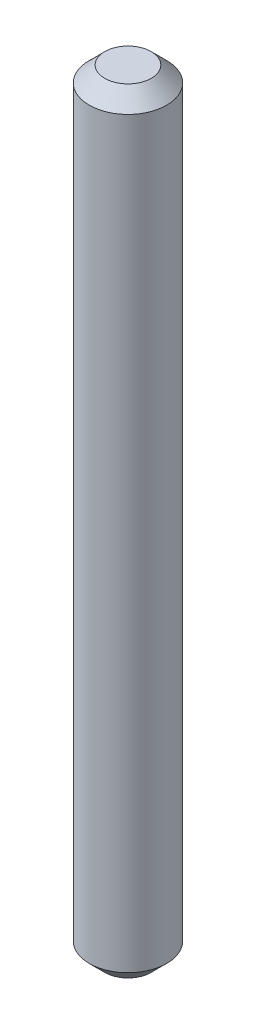
ISO-10303-21;
HEADER;
FILE_DESCRIPTION(('STEP AP214'),'2;1');
FILE_NAME('part.step','',(''),(''),'','','');
FILE_SCHEMA(('AUTOMOTIVE_DESIGN { 1 0 10303 214 1 1 1 1 }'));
ENDSEC;
DATA;
#1=APPLICATION_CONTEXT('core data for automotive mechanical design processes');
#2=APPLICATION_PROTOCOL_DEFINITION('international standard','automotive_design',2000,#1);
#3=PRODUCT_CONTEXT('',#1,'mechanical');
#4=PRODUCT('Part','Part','',(#3));
#5=PRODUCT_RELATED_PRODUCT_CATEGORY('part','',(#4));
#6=PRODUCT_DEFINITION_FORMATION('','',#4);
#7=PRODUCT_DEFINITION_CONTEXT('part definition',#1,'design');
#8=PRODUCT_DEFINITION('design','',#6,#7);
#9=PRODUCT_DEFINITION_SHAPE('','',#8);
#10=(LENGTH_UNIT() NAMED_UNIT(*) SI_UNIT(.MILLI.,.METRE.));
#11=(NAMED_UNIT(*) PLANE_ANGLE_UNIT() SI_UNIT($,.RADIAN.));
#12=(NAMED_UNIT(*) SI_UNIT($,.STERADIAN.) SOLID_ANGLE_UNIT());
#13=UNCERTAINTY_MEASURE_WITH_UNIT(LENGTH_MEASURE(1.E-05),#10,'distance_accuracy_value','');
#14=(GEOMETRIC_REPRESENTATION_CONTEXT(3) GLOBAL_UNCERTAINTY_ASSIGNED_CONTEXT((#13)) GLOBAL_UNIT_ASSIGNED_CONTEXT((#10,
#11,#12)) REPRESENTATION_CONTEXT('',''));
#15=CARTESIAN_POINT('',(0.,0.,0.));
#16=DIRECTION('',(0.,0.,1.));
#17=DIRECTION('',(1.,0.,0.));
#18=AXIS2_PLACEMENT_3D('',#15,#16,#17);
#19=CARTESIAN_POINT('',(0.,50.,0.));
#20=DIRECTION('',(0.,-1.,0.));
#21=DIRECTION('',(0.,0.,-1.));
#22=AXIS2_PLACEMENT_3D('',#19,#20,#21);
#23=CYLINDRICAL_SURFACE('',#22,2.5);
#24=CARTESIAN_POINT('',(0.,1.00000000000001,0.));
#25=DIRECTION('',(0.,1.,0.));
#26=DIRECTION('',(0.,0.,1.));
#27=AXIS2_PLACEMENT_3D('',#24,#25,#26);
#28=CIRCLE('',#27,2.5);
#29=CARTESIAN_POINT('',(0.,1.00000000000001,2.5));
#30=VERTEX_POINT('',#29);
#31=EDGE_CURVE('E48',#30,#30,#28,.T.);
#32=ORIENTED_EDGE('',*,*,#31,.T.);
#33=EDGE_LOOP('',(#32));
#34=FACE_BOUND('',#33,.T.);
#35=CARTESIAN_POINT('',(0.,49.,0.));
#36=DIRECTION('',(0.,1.,0.));
#37=DIRECTION('',(0.,0.,1.));
#38=AXIS2_PLACEMENT_3D('',#35,#36,#37);
#39=CIRCLE('',#38,2.5);
#40=CARTESIAN_POINT('',(0.,49.,2.5));
#41=VERTEX_POINT('',#40);
#42=EDGE_CURVE('E53',#41,#41,#39,.F.);
#43=ORIENTED_EDGE('',*,*,#42,.T.);
#44=EDGE_LOOP('',(#43));
#45=FACE_BOUND('',#44,.T.);
#46=ADVANCED_FACE('F34',(#34,#45),#23,.T.);
#47=CARTESIAN_POINT('',(0.,50.,0.));
#48=DIRECTION('',(0.,1.,0.));
#49=DIRECTION('',(0.,0.,1.));
#50=AXIS2_PLACEMENT_3D('',#47,#48,#49);
#51=PLANE('',#50);
#52=CARTESIAN_POINT('',(0.,50.,0.));
#53=DIRECTION('',(0.,1.,0.));
#54=DIRECTION('',(0.,0.,1.));
#55=AXIS2_PLACEMENT_3D('',#52,#53,#54);
#56=CIRCLE('',#55,1.49999999999999);
#57=CARTESIAN_POINT('',(0.,50.,1.49999999999999));
#58=VERTEX_POINT('',#57);
#59=EDGE_CURVE('E10',#58,#58,#56,.T.);
#60=ORIENTED_EDGE('',*,*,#59,.T.);
#61=EDGE_LOOP('',(#60));
#62=FACE_BOUND('',#61,.T.);
#63=ADVANCED_FACE('F69',(#62),#51,.T.);
#64=CARTESIAN_POINT('',(0.,0.,0.));
#65=DIRECTION('',(0.,1.,0.));
#66=DIRECTION('',(0.,0.,1.));
#67=AXIS2_PLACEMENT_3D('',#64,#65,#66);
#68=PLANE('',#67);
#69=CARTESIAN_POINT('',(0.,0.,0.));
#70=DIRECTION('',(0.,1.,0.));
#71=DIRECTION('',(0.,0.,1.));
#72=AXIS2_PLACEMENT_3D('',#69,#70,#71);
#73=CIRCLE('',#72,1.49999999999999);
#74=CARTESIAN_POINT('',(0.,0.,1.49999999999999));
#75=VERTEX_POINT('',#74);
#76=EDGE_CURVE('E42',#75,#75,#73,.F.);
#77=ORIENTED_EDGE('',*,*,#76,.T.);
#78=EDGE_LOOP('',(#77));
#79=FACE_BOUND('',#78,.T.);
#80=ADVANCED_FACE('F66',(#79),#68,.F.);
#81=CARTESIAN_POINT('',(0.,1.00000000000001,0.));
#82=DIRECTION('',(0.,1.,0.));
#83=DIRECTION('',(0.,0.,1.));
#84=AXIS2_PLACEMENT_3D('',#81,#82,#83);
#85=CONICAL_SURFACE('',#84,2.5,0.785398163397451);
#86=ORIENTED_EDGE('',*,*,#76,.F.);
#87=EDGE_LOOP('',(#86));
#88=FACE_BOUND('',#87,.T.);
#89=ORIENTED_EDGE('',*,*,#31,.F.);
#90=EDGE_LOOP('',(#89));
#91=FACE_BOUND('',#90,.T.);
#92=ADVANCED_FACE('F62',(#88,#91),#85,.T.);
#93=CARTESIAN_POINT('',(0.,50.,0.));
#94=DIRECTION('',(0.,-1.,0.));
#95=DIRECTION('',(0.,0.,-1.));
#96=AXIS2_PLACEMENT_3D('',#93,#94,#95);
#97=CONICAL_SURFACE('',#96,1.49999999999999,0.785398163397447);
#98=ORIENTED_EDGE('',*,*,#42,.F.);
#99=EDGE_LOOP('',(#98));
#100=FACE_BOUND('',#99,.T.);
#101=ORIENTED_EDGE('',*,*,#59,.F.);
#102=EDGE_LOOP('',(#101));
#103=FACE_BOUND('',#102,.T.);
#104=ADVANCED_FACE('F36',(#100,#103),#97,.T.);
#105=CLOSED_SHELL('',(#46,#63,#80,#92,#104));
#106=MANIFOLD_SOLID_BREP('B2',#105);
#107=ADVANCED_BREP_SHAPE_REPRESENTATION('',(#18,#106),#14);
#108=SHAPE_DEFINITION_REPRESENTATION(#9,#107);
ENDSEC;
END-ISO-10303-21;
